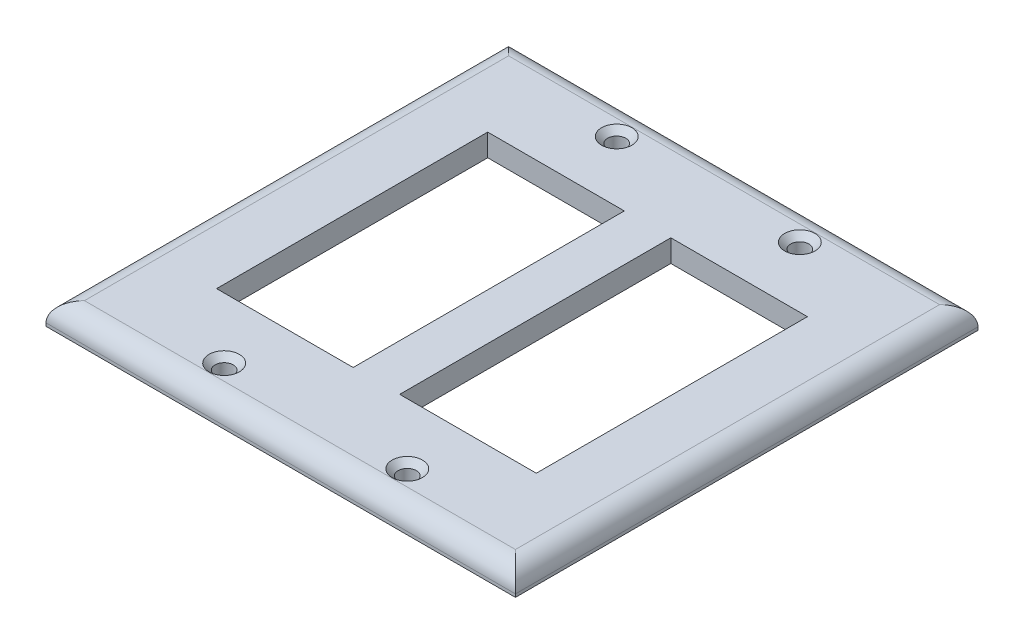
ISO-10303-21;
HEADER;
FILE_DESCRIPTION(('STEP AP214'),'2;1');
FILE_NAME('part.step','',(''),(''),'','','');
FILE_SCHEMA(('AUTOMOTIVE_DESIGN { 1 0 10303 214 1 1 1 1 }'));
ENDSEC;
DATA;
#1=APPLICATION_CONTEXT('core data for automotive mechanical design processes');
#2=APPLICATION_PROTOCOL_DEFINITION('international standard','automotive_design',2000,#1);
#3=PRODUCT_CONTEXT('',#1,'mechanical');
#4=PRODUCT('Part','Part','',(#3));
#5=PRODUCT_RELATED_PRODUCT_CATEGORY('part','',(#4));
#6=PRODUCT_DEFINITION_FORMATION('','',#4);
#7=PRODUCT_DEFINITION_CONTEXT('part definition',#1,'design');
#8=PRODUCT_DEFINITION('design','',#6,#7);
#9=PRODUCT_DEFINITION_SHAPE('','',#8);
#10=(LENGTH_UNIT() NAMED_UNIT(*) SI_UNIT(.MILLI.,.METRE.));
#11=(NAMED_UNIT(*) PLANE_ANGLE_UNIT() SI_UNIT($,.RADIAN.));
#12=(NAMED_UNIT(*) SI_UNIT($,.STERADIAN.) SOLID_ANGLE_UNIT());
#13=UNCERTAINTY_MEASURE_WITH_UNIT(LENGTH_MEASURE(1.E-05),#10,'distance_accuracy_value','');
#14=(GEOMETRIC_REPRESENTATION_CONTEXT(3) GLOBAL_UNCERTAINTY_ASSIGNED_CONTEXT((#13)) GLOBAL_UNIT_ASSIGNED_CONTEXT((#10,
#11,#12)) REPRESENTATION_CONTEXT('',''));
#15=CARTESIAN_POINT('',(0.,0.,0.));
#16=DIRECTION('',(0.,0.,1.));
#17=DIRECTION('',(1.,0.,0.));
#18=AXIS2_PLACEMENT_3D('',#15,#16,#17);
#19=CARTESIAN_POINT('',(0.,5.5,0.));
#20=DIRECTION('',(0.,1.,0.));
#21=DIRECTION('',(0.,0.,1.));
#22=AXIS2_PLACEMENT_3D('',#19,#20,#21);
#23=PLANE('',#22);
#24=CARTESIAN_POINT('',(30.7504052679415,5.5,75.6770644960488));
#25=DIRECTION('',(0.,1.,0.));
#26=DIRECTION('',(0.,0.,1.));
#27=AXIS2_PLACEMENT_3D('',#24,#25,#26);
#28=CIRCLE('',#27,3.75000000000002);
#29=CARTESIAN_POINT('',(30.7504052679415,5.5,79.4270644960488));
#30=VERTEX_POINT('',#29);
#31=EDGE_CURVE('E304',#30,#30,#28,.F.);
#32=ORIENTED_EDGE('',*,*,#31,.T.);
#33=EDGE_LOOP('',(#32));
#34=FACE_BOUND('',#33,.T.);
#35=CARTESIAN_POINT('',(-14.4995947320585,5.5,75.6770644960488));
#36=DIRECTION('',(0.,1.,0.));
#37=DIRECTION('',(0.,0.,1.));
#38=AXIS2_PLACEMENT_3D('',#35,#36,#37);
#39=CIRCLE('',#38,3.75000000000002);
#40=CARTESIAN_POINT('',(-14.4995947320585,5.5,79.4270644960488));
#41=VERTEX_POINT('',#40);
#42=EDGE_CURVE('E301',#41,#41,#39,.F.);
#43=ORIENTED_EDGE('',*,*,#42,.T.);
#44=EDGE_LOOP('',(#43));
#45=FACE_BOUND('',#44,.T.);
#46=CARTESIAN_POINT('',(30.7504052679415,5.5,-21.3229355039512));
#47=DIRECTION('',(0.,1.,0.));
#48=DIRECTION('',(0.,0.,1.));
#49=AXIS2_PLACEMENT_3D('',#46,#47,#48);
#50=CIRCLE('',#49,3.75000000000002);
#51=CARTESIAN_POINT('',(30.7504052679415,5.5,-17.5729355039512));
#52=VERTEX_POINT('',#51);
#53=EDGE_CURVE('E298',#52,#52,#50,.F.);
#54=ORIENTED_EDGE('',*,*,#53,.T.);
#55=EDGE_LOOP('',(#54));
#56=FACE_BOUND('',#55,.T.);
#57=CARTESIAN_POINT('',(-14.4995947320585,5.5,-21.3229355039512));
#58=DIRECTION('',(0.,1.,0.));
#59=DIRECTION('',(0.,0.,1.));
#60=AXIS2_PLACEMENT_3D('',#57,#58,#59);
#61=CIRCLE('',#60,3.75000000000002);
#62=CARTESIAN_POINT('',(-14.4995947320585,5.5,-17.5729355039512));
#63=VERTEX_POINT('',#62);
#64=EDGE_CURVE('E295',#63,#63,#61,.F.);
#65=ORIENTED_EDGE('',*,*,#64,.T.);
#66=EDGE_LOOP('',(#65));
#67=FACE_BOUND('',#66,.T.);
#68=DIRECTION('',(1.,0.,0.));
#69=VECTOR('',#68,1.);
#70=CARTESIAN_POINT('',(0.,5.5,-25.2229355039512));
#71=LINE('',#70,#69);
#72=CARTESIAN_POINT('',(61.3754052679415,5.5,-25.2229355039512));
#73=VERTEX_POINT('',#72);
#74=CARTESIAN_POINT('',(-45.1245947320585,5.5,-25.2229355039512));
#75=VERTEX_POINT('',#74);
#76=EDGE_CURVE('E260',#73,#75,#71,.F.);
#77=ORIENTED_EDGE('',*,*,#76,.T.);
#78=DIRECTION('',(0.,0.,1.));
#79=VECTOR('',#78,1.);
#80=CARTESIAN_POINT('',(-45.1245947320585,5.5,84.3270644960488));
#81=LINE('',#80,#79);
#82=CARTESIAN_POINT('',(-45.1245947320585,5.5,79.5770644960488));
#83=VERTEX_POINT('',#82);
#84=EDGE_CURVE('E273',#75,#83,#81,.T.);
#85=ORIENTED_EDGE('',*,*,#84,.T.);
#86=DIRECTION('',(1.,0.,0.));
#87=VECTOR('',#86,1.);
#88=CARTESIAN_POINT('',(66.1254052679415,5.5,79.5770644960488));
#89=LINE('',#88,#87);
#90=CARTESIAN_POINT('',(61.3754052679415,5.5,79.5770644960488));
#91=VERTEX_POINT('',#90);
#92=EDGE_CURVE('E271',#83,#91,#89,.T.);
#93=ORIENTED_EDGE('',*,*,#92,.T.);
#94=DIRECTION('',(0.,0.,1.));
#95=VECTOR('',#94,1.);
#96=CARTESIAN_POINT('',(61.3754052679415,5.5,0.));
#97=LINE('',#96,#95);
#98=EDGE_CURVE('E269',#91,#73,#97,.F.);
#99=ORIENTED_EDGE('',*,*,#98,.T.);
#100=EDGE_LOOP('',(#77,#85,#93,#99));
#101=FACE_BOUND('',#100,.T.);
#102=DIRECTION('',(0.,0.,1.));
#103=VECTOR('',#102,1.);
#104=CARTESIAN_POINT('',(13.8754052679415,5.5,0.));
#105=LINE('',#104,#103);
#106=CARTESIAN_POINT('',(13.8754052679415,5.5,-6.32293550395119));
#107=VERTEX_POINT('',#106);
#108=CARTESIAN_POINT('',(13.8754052679415,5.5,60.6770644960488));
#109=VERTEX_POINT('',#108);
#110=EDGE_CURVE('E204',#107,#109,#105,.T.);
#111=ORIENTED_EDGE('',*,*,#110,.F.);
#112=DIRECTION('',(1.,0.,0.));
#113=VECTOR('',#112,1.);
#114=CARTESIAN_POINT('',(0.,5.5,-6.32293550395119));
#115=LINE('',#114,#113);
#116=CARTESIAN_POINT('',(47.6254052679415,5.5,-6.32293550395119));
#117=VERTEX_POINT('',#116);
#118=EDGE_CURVE('E207',#107,#117,#115,.T.);
#119=ORIENTED_EDGE('',*,*,#118,.T.);
#120=DIRECTION('',(0.,0.,1.));
#121=VECTOR('',#120,1.);
#122=CARTESIAN_POINT('',(47.6254052679415,5.5,0.));
#123=LINE('',#122,#121);
#124=CARTESIAN_POINT('',(47.6254052679415,5.5,60.6770644960488));
#125=VERTEX_POINT('',#124);
#126=EDGE_CURVE('E211',#117,#125,#123,.T.);
#127=ORIENTED_EDGE('',*,*,#126,.T.);
#128=DIRECTION('',(1.,0.,0.));
#129=VECTOR('',#128,1.);
#130=CARTESIAN_POINT('',(0.,5.5,60.6770644960488));
#131=LINE('',#130,#129);
#132=EDGE_CURVE('E213',#109,#125,#131,.T.);
#133=ORIENTED_EDGE('',*,*,#132,.F.);
#134=EDGE_LOOP('',(#111,#119,#127,#133));
#135=FACE_BOUND('',#134,.T.);
#136=DIRECTION('',(0.,0.,1.));
#137=VECTOR('',#136,1.);
#138=CARTESIAN_POINT('',(2.37540526794149,5.5,-6.32293550395119));
#139=LINE('',#138,#137);
#140=CARTESIAN_POINT('',(2.37540526794149,5.5,-6.32293550395119));
#141=VERTEX_POINT('',#140);
#142=CARTESIAN_POINT('',(2.37540526794149,5.5,60.6770644960488));
#143=VERTEX_POINT('',#142);
#144=EDGE_CURVE('E172',#141,#143,#139,.T.);
#145=ORIENTED_EDGE('',*,*,#144,.T.);
#146=DIRECTION('',(1.,0.,0.));
#147=VECTOR('',#146,1.);
#148=CARTESIAN_POINT('',(-31.3745947320585,5.5,60.6770644960488));
#149=LINE('',#148,#147);
#150=CARTESIAN_POINT('',(-31.3745947320585,5.5,60.6770644960488));
#151=VERTEX_POINT('',#150);
#152=EDGE_CURVE('E162',#151,#143,#149,.T.);
#153=ORIENTED_EDGE('',*,*,#152,.F.);
#154=DIRECTION('',(0.,0.,1.));
#155=VECTOR('',#154,1.);
#156=CARTESIAN_POINT('',(-31.3745947320585,5.5,-6.32293550395119));
#157=LINE('',#156,#155);
#158=CARTESIAN_POINT('',(-31.3745947320585,5.5,-6.32293550395119));
#159=VERTEX_POINT('',#158);
#160=EDGE_CURVE('E187',#159,#151,#157,.T.);
#161=ORIENTED_EDGE('',*,*,#160,.F.);
#162=DIRECTION('',(1.,0.,0.));
#163=VECTOR('',#162,1.);
#164=CARTESIAN_POINT('',(-31.3745947320585,5.5,-6.32293550395119));
#165=LINE('',#164,#163);
#166=EDGE_CURVE('E185',#159,#141,#165,.T.);
#167=ORIENTED_EDGE('',*,*,#166,.T.);
#168=EDGE_LOOP('',(#145,#153,#161,#167));
#169=FACE_BOUND('',#168,.T.);
#170=ADVANCED_FACE('F60',(#34,#45,#56,#67,#101,#135,#169),#23,.T.);
#171=CARTESIAN_POINT('',(0.,0.,0.));
#172=DIRECTION('',(0.,1.,0.));
#173=DIRECTION('',(0.,0.,1.));
#174=AXIS2_PLACEMENT_3D('',#171,#172,#173);
#175=PLANE('',#174);
#176=DIRECTION('',(0.,0.,1.));
#177=VECTOR('',#176,1.);
#178=CARTESIAN_POINT('',(66.1254052679415,0.,0.));
#179=LINE('',#178,#177);
#180=CARTESIAN_POINT('',(66.1254052679415,0.,-29.9729355039512));
#181=VERTEX_POINT('',#180);
#182=CARTESIAN_POINT('',(66.1254052679415,0.,84.3270644960488));
#183=VERTEX_POINT('',#182);
#184=EDGE_CURVE('E240',#181,#183,#179,.T.);
#185=ORIENTED_EDGE('',*,*,#184,.T.);
#186=DIRECTION('',(1.,0.,0.));
#187=VECTOR('',#186,1.);
#188=CARTESIAN_POINT('',(0.,0.,84.3270644960488));
#189=LINE('',#188,#187);
#190=CARTESIAN_POINT('',(-49.8745947320585,0.,84.3270644960488));
#191=VERTEX_POINT('',#190);
#192=EDGE_CURVE('E208',#191,#183,#189,.T.);
#193=ORIENTED_EDGE('',*,*,#192,.F.);
#194=DIRECTION('',(0.,0.,1.));
#195=VECTOR('',#194,1.);
#196=CARTESIAN_POINT('',(-49.8745947320585,0.,0.));
#197=LINE('',#196,#195);
#198=CARTESIAN_POINT('',(-49.8745947320585,0.,-29.9729355039512));
#199=VERTEX_POINT('',#198);
#200=EDGE_CURVE('E246',#199,#191,#197,.T.);
#201=ORIENTED_EDGE('',*,*,#200,.F.);
#202=DIRECTION('',(1.,0.,0.));
#203=VECTOR('',#202,1.);
#204=CARTESIAN_POINT('',(0.,0.,-29.9729355039512));
#205=LINE('',#204,#203);
#206=EDGE_CURVE('E243',#199,#181,#205,.T.);
#207=ORIENTED_EDGE('',*,*,#206,.T.);
#208=EDGE_LOOP('',(#185,#193,#201,#207));
#209=FACE_BOUND('',#208,.T.);
#210=DIRECTION('',(0.,0.,1.));
#211=VECTOR('',#210,1.);
#212=CARTESIAN_POINT('',(13.8754052679415,0.,0.));
#213=LINE('',#212,#211);
#214=CARTESIAN_POINT('',(13.8754052679415,0.,-6.32293550395119));
#215=VERTEX_POINT('',#214);
#216=CARTESIAN_POINT('',(13.8754052679415,0.,60.6770644960488));
#217=VERTEX_POINT('',#216);
#218=EDGE_CURVE('E228',#215,#217,#213,.T.);
#219=ORIENTED_EDGE('',*,*,#218,.T.);
#220=DIRECTION('',(1.,0.,0.));
#221=VECTOR('',#220,1.);
#222=CARTESIAN_POINT('',(0.,0.,60.6770644960488));
#223=LINE('',#222,#221);
#224=CARTESIAN_POINT('',(47.6254052679415,0.,60.6770644960488));
#225=VERTEX_POINT('',#224);
#226=EDGE_CURVE('E237',#217,#225,#223,.T.);
#227=ORIENTED_EDGE('',*,*,#226,.T.);
#228=DIRECTION('',(0.,0.,1.));
#229=VECTOR('',#228,1.);
#230=CARTESIAN_POINT('',(47.6254052679415,0.,0.));
#231=LINE('',#230,#229);
#232=CARTESIAN_POINT('',(47.6254052679415,0.,-6.32293550395119));
#233=VERTEX_POINT('',#232);
#234=EDGE_CURVE('E234',#233,#225,#231,.T.);
#235=ORIENTED_EDGE('',*,*,#234,.F.);
#236=DIRECTION('',(1.,0.,0.));
#237=VECTOR('',#236,1.);
#238=CARTESIAN_POINT('',(0.,0.,-6.32293550395119));
#239=LINE('',#238,#237);
#240=EDGE_CURVE('E231',#215,#233,#239,.T.);
#241=ORIENTED_EDGE('',*,*,#240,.F.);
#242=EDGE_LOOP('',(#219,#227,#235,#241));
#243=FACE_BOUND('',#242,.T.);
#244=CARTESIAN_POINT('',(-14.4995947320585,0.,-21.3229355039512));
#245=DIRECTION('',(0.,1.,0.));
#246=DIRECTION('',(0.,0.,1.));
#247=AXIS2_PLACEMENT_3D('',#244,#245,#246);
#248=CIRCLE('',#247,2.25);
#249=CARTESIAN_POINT('',(-14.4995947320585,0.,-19.0729355039512));
#250=VERTEX_POINT('',#249);
#251=EDGE_CURVE('E225',#250,#250,#248,.T.);
#252=ORIENTED_EDGE('',*,*,#251,.T.);
#253=EDGE_LOOP('',(#252));
#254=FACE_BOUND('',#253,.T.);
#255=CARTESIAN_POINT('',(-14.4995947320585,0.,75.6770644960488));
#256=DIRECTION('',(0.,1.,0.));
#257=DIRECTION('',(0.,0.,1.));
#258=AXIS2_PLACEMENT_3D('',#255,#256,#257);
#259=CIRCLE('',#258,2.25);
#260=CARTESIAN_POINT('',(-14.4995947320585,0.,77.9270644960488));
#261=VERTEX_POINT('',#260);
#262=EDGE_CURVE('E222',#261,#261,#259,.T.);
#263=ORIENTED_EDGE('',*,*,#262,.T.);
#264=EDGE_LOOP('',(#263));
#265=FACE_BOUND('',#264,.T.);
#266=CARTESIAN_POINT('',(30.7504052679415,0.,75.6770644960488));
#267=DIRECTION('',(0.,1.,0.));
#268=DIRECTION('',(0.,0.,1.));
#269=AXIS2_PLACEMENT_3D('',#266,#267,#268);
#270=CIRCLE('',#269,2.25000000000001);
#271=CARTESIAN_POINT('',(30.7504052679415,0.,77.9270644960488));
#272=VERTEX_POINT('',#271);
#273=EDGE_CURVE('E219',#272,#272,#270,.T.);
#274=ORIENTED_EDGE('',*,*,#273,.T.);
#275=EDGE_LOOP('',(#274));
#276=FACE_BOUND('',#275,.T.);
#277=CARTESIAN_POINT('',(30.7504052679415,0.,-21.3229355039512));
#278=DIRECTION('',(0.,1.,0.));
#279=DIRECTION('',(0.,0.,1.));
#280=AXIS2_PLACEMENT_3D('',#277,#278,#279);
#281=CIRCLE('',#280,2.25);
#282=CARTESIAN_POINT('',(30.7504052679415,0.,-19.0729355039512));
#283=VERTEX_POINT('',#282);
#284=EDGE_CURVE('E182',#283,#283,#281,.T.);
#285=ORIENTED_EDGE('',*,*,#284,.T.);
#286=EDGE_LOOP('',(#285));
#287=FACE_BOUND('',#286,.T.);
#288=DIRECTION('',(1.,0.,0.));
#289=VECTOR('',#288,1.);
#290=CARTESIAN_POINT('',(-31.3745947320585,0.,60.6770644960488));
#291=LINE('',#290,#289);
#292=CARTESIAN_POINT('',(-31.3745947320585,0.,60.6770644960488));
#293=VERTEX_POINT('',#292);
#294=CARTESIAN_POINT('',(2.37540526794149,0.,60.6770644960488));
#295=VERTEX_POINT('',#294);
#296=EDGE_CURVE('E191',#293,#295,#291,.T.);
#297=ORIENTED_EDGE('',*,*,#296,.T.);
#298=DIRECTION('',(0.,0.,1.));
#299=VECTOR('',#298,1.);
#300=CARTESIAN_POINT('',(2.37540526794149,0.,-6.32293550395119));
#301=LINE('',#300,#299);
#302=CARTESIAN_POINT('',(2.37540526794149,0.,-6.32293550395119));
#303=VERTEX_POINT('',#302);
#304=EDGE_CURVE('E180',#303,#295,#301,.T.);
#305=ORIENTED_EDGE('',*,*,#304,.F.);
#306=DIRECTION('',(1.,0.,0.));
#307=VECTOR('',#306,1.);
#308=CARTESIAN_POINT('',(-31.3745947320585,0.,-6.32293550395119));
#309=LINE('',#308,#307);
#310=CARTESIAN_POINT('',(-31.3745947320585,0.,-6.32293550395119));
#311=VERTEX_POINT('',#310);
#312=EDGE_CURVE('E195',#311,#303,#309,.T.);
#313=ORIENTED_EDGE('',*,*,#312,.F.);
#314=DIRECTION('',(0.,0.,1.));
#315=VECTOR('',#314,1.);
#316=CARTESIAN_POINT('',(-31.3745947320585,0.,-6.32293550395119));
#317=LINE('',#316,#315);
#318=EDGE_CURVE('E173',#311,#293,#317,.T.);
#319=ORIENTED_EDGE('',*,*,#318,.T.);
#320=EDGE_LOOP('',(#297,#305,#313,#319));
#321=FACE_BOUND('',#320,.T.);
#322=ADVANCED_FACE('F329',(#209,#243,#254,#265,#276,#287,#321),#175,.F.);
#323=CARTESIAN_POINT('',(66.1254052679415,5.5,0.));
#324=DIRECTION('',(1.,0.,0.));
#325=DIRECTION('',(0.,0.,-1.));
#326=AXIS2_PLACEMENT_3D('',#323,#324,#325);
#327=PLANE('',#326);
#328=DIRECTION('',(0.,-1.,0.));
#329=VECTOR('',#328,1.);
#330=CARTESIAN_POINT('',(66.1254052679415,5.5,-29.9729355039512));
#331=LINE('',#330,#329);
#332=CARTESIAN_POINT('',(66.1254052679415,0.75,-29.9729355039512));
#333=VERTEX_POINT('',#332);
#334=EDGE_CURVE('E258',#333,#181,#331,.T.);
#335=ORIENTED_EDGE('',*,*,#334,.F.);
#336=DIRECTION('',(0.,0.,1.));
#337=VECTOR('',#336,1.);
#338=CARTESIAN_POINT('',(66.1254052679415,0.75,0.));
#339=LINE('',#338,#337);
#340=CARTESIAN_POINT('',(66.1254052679415,0.75,84.3270644960488));
#341=VERTEX_POINT('',#340);
#342=EDGE_CURVE('E82',#333,#341,#339,.T.);
#343=ORIENTED_EDGE('',*,*,#342,.T.);
#344=DIRECTION('',(0.,-1.,0.));
#345=VECTOR('',#344,1.);
#346=CARTESIAN_POINT('',(66.1254052679415,5.5,84.3270644960488));
#347=LINE('',#346,#345);
#348=EDGE_CURVE('E251',#341,#183,#347,.T.);
#349=ORIENTED_EDGE('',*,*,#348,.T.);
#350=ORIENTED_EDGE('',*,*,#184,.F.);
#351=EDGE_LOOP('',(#335,#343,#349,#350));
#352=FACE_BOUND('',#351,.T.);
#353=ADVANCED_FACE('F335',(#352),#327,.T.);
#354=CARTESIAN_POINT('',(0.,5.5,-29.9729355039512));
#355=DIRECTION('',(0.,0.,-1.));
#356=DIRECTION('',(-1.,0.,0.));
#357=AXIS2_PLACEMENT_3D('',#354,#355,#356);
#358=PLANE('',#357);
#359=DIRECTION('',(0.,-1.,0.));
#360=VECTOR('',#359,1.);
#361=CARTESIAN_POINT('',(-49.8745947320585,5.5,-29.9729355039512));
#362=LINE('',#361,#360);
#363=CARTESIAN_POINT('',(-49.8745947320585,0.75,-29.9729355039512));
#364=VERTEX_POINT('',#363);
#365=EDGE_CURVE('E256',#364,#199,#362,.T.);
#366=ORIENTED_EDGE('',*,*,#365,.F.);
#367=DIRECTION('',(1.,0.,0.));
#368=VECTOR('',#367,1.);
#369=CARTESIAN_POINT('',(0.,0.75,-29.9729355039512));
#370=LINE('',#369,#368);
#371=EDGE_CURVE('E75',#364,#333,#370,.T.);
#372=ORIENTED_EDGE('',*,*,#371,.T.);
#373=ORIENTED_EDGE('',*,*,#334,.T.);
#374=ORIENTED_EDGE('',*,*,#206,.F.);
#375=EDGE_LOOP('',(#366,#372,#373,#374));
#376=FACE_BOUND('',#375,.T.);
#377=ADVANCED_FACE('F350',(#376),#358,.T.);
#378=CARTESIAN_POINT('',(-49.8745947320585,5.5,0.));
#379=DIRECTION('',(1.,0.,0.));
#380=DIRECTION('',(0.,0.,-1.));
#381=AXIS2_PLACEMENT_3D('',#378,#379,#380);
#382=PLANE('',#381);
#383=DIRECTION('',(0.,-1.,0.));
#384=VECTOR('',#383,1.);
#385=CARTESIAN_POINT('',(-49.8745947320585,5.5,84.3270644960488));
#386=LINE('',#385,#384);
#387=CARTESIAN_POINT('',(-49.8745947320585,0.75,84.3270644960488));
#388=VERTEX_POINT('',#387);
#389=EDGE_CURVE('E253',#388,#191,#386,.T.);
#390=ORIENTED_EDGE('',*,*,#389,.F.);
#391=DIRECTION('',(0.,0.,1.));
#392=VECTOR('',#391,1.);
#393=CARTESIAN_POINT('',(-49.8745947320585,0.75,-29.9729355039512));
#394=LINE('',#393,#392);
#395=EDGE_CURVE('E276',#388,#364,#394,.F.);
#396=ORIENTED_EDGE('',*,*,#395,.T.);
#397=ORIENTED_EDGE('',*,*,#365,.T.);
#398=ORIENTED_EDGE('',*,*,#200,.T.);
#399=EDGE_LOOP('',(#390,#396,#397,#398));
#400=FACE_BOUND('',#399,.T.);
#401=ADVANCED_FACE('F346',(#400),#382,.F.);
#402=CARTESIAN_POINT('',(13.8754052679415,5.5,0.));
#403=DIRECTION('',(1.,0.,0.));
#404=DIRECTION('',(0.,0.,-1.));
#405=AXIS2_PLACEMENT_3D('',#402,#403,#404);
#406=PLANE('',#405);
#407=ORIENTED_EDGE('',*,*,#218,.F.);
#408=DIRECTION('',(0.,-1.,0.));
#409=VECTOR('',#408,1.);
#410=CARTESIAN_POINT('',(13.8754052679415,5.5,-6.32293550395119));
#411=LINE('',#410,#409);
#412=EDGE_CURVE('E254',#107,#215,#411,.T.);
#413=ORIENTED_EDGE('',*,*,#412,.F.);
#414=ORIENTED_EDGE('',*,*,#110,.T.);
#415=DIRECTION('',(0.,-1.,0.));
#416=VECTOR('',#415,1.);
#417=CARTESIAN_POINT('',(13.8754052679415,5.5,60.6770644960488));
#418=LINE('',#417,#416);
#419=EDGE_CURVE('E216',#109,#217,#418,.T.);
#420=ORIENTED_EDGE('',*,*,#419,.T.);
#421=EDGE_LOOP('',(#407,#413,#414,#420));
#422=FACE_BOUND('',#421,.T.);
#423=ADVANCED_FACE('F349',(#422),#406,.T.);
#424=CARTESIAN_POINT('',(0.,5.5,-6.32293550395119));
#425=DIRECTION('',(0.,0.,-1.));
#426=DIRECTION('',(-1.,0.,0.));
#427=AXIS2_PLACEMENT_3D('',#424,#425,#426);
#428=PLANE('',#427);
#429=ORIENTED_EDGE('',*,*,#240,.T.);
#430=DIRECTION('',(0.,-1.,0.));
#431=VECTOR('',#430,1.);
#432=CARTESIAN_POINT('',(47.6254052679415,5.5,-6.32293550395119));
#433=LINE('',#432,#431);
#434=EDGE_CURVE('E264',#117,#233,#433,.T.);
#435=ORIENTED_EDGE('',*,*,#434,.F.);
#436=ORIENTED_EDGE('',*,*,#118,.F.);
#437=ORIENTED_EDGE('',*,*,#412,.T.);
#438=EDGE_LOOP('',(#429,#435,#436,#437));
#439=FACE_BOUND('',#438,.T.);
#440=ADVANCED_FACE('F364',(#439),#428,.F.);
#441=CARTESIAN_POINT('',(47.6254052679415,5.5,0.));
#442=DIRECTION('',(1.,0.,0.));
#443=DIRECTION('',(0.,0.,-1.));
#444=AXIS2_PLACEMENT_3D('',#441,#442,#443);
#445=PLANE('',#444);
#446=ORIENTED_EDGE('',*,*,#234,.T.);
#447=DIRECTION('',(0.,-1.,0.));
#448=VECTOR('',#447,1.);
#449=CARTESIAN_POINT('',(47.6254052679415,5.5,60.6770644960488));
#450=LINE('',#449,#448);
#451=EDGE_CURVE('E262',#125,#225,#450,.T.);
#452=ORIENTED_EDGE('',*,*,#451,.F.);
#453=ORIENTED_EDGE('',*,*,#126,.F.);
#454=ORIENTED_EDGE('',*,*,#434,.T.);
#455=EDGE_LOOP('',(#446,#452,#453,#454));
#456=FACE_BOUND('',#455,.T.);
#457=ADVANCED_FACE('F360',(#456),#445,.F.);
#458=CARTESIAN_POINT('',(0.,5.5,60.6770644960488));
#459=DIRECTION('',(0.,0.,-1.));
#460=DIRECTION('',(-1.,0.,0.));
#461=AXIS2_PLACEMENT_3D('',#458,#459,#460);
#462=PLANE('',#461);
#463=ORIENTED_EDGE('',*,*,#226,.F.);
#464=ORIENTED_EDGE('',*,*,#419,.F.);
#465=ORIENTED_EDGE('',*,*,#132,.T.);
#466=ORIENTED_EDGE('',*,*,#451,.T.);
#467=EDGE_LOOP('',(#463,#464,#465,#466));
#468=FACE_BOUND('',#467,.T.);
#469=ADVANCED_FACE('F356',(#468),#462,.T.);
#470=CARTESIAN_POINT('',(-14.4995947320585,5.5,-21.3229355039512));
#471=DIRECTION('',(0.,-1.,0.));
#472=DIRECTION('',(0.,0.,-1.));
#473=AXIS2_PLACEMENT_3D('',#470,#471,#472);
#474=CYLINDRICAL_SURFACE('',#473,2.25);
#475=CARTESIAN_POINT('',(-14.4995947320585,3.99999999999997,-21.3229355039512));
#476=DIRECTION('',(0.,1.,0.));
#477=DIRECTION('',(0.,0.,1.));
#478=AXIS2_PLACEMENT_3D('',#475,#476,#477);
#479=CIRCLE('',#478,2.25);
#480=CARTESIAN_POINT('',(-14.4995947320585,3.99999999999997,-19.0729355039512));
#481=VERTEX_POINT('',#480);
#482=EDGE_CURVE('E12',#481,#481,#479,.T.);
#483=ORIENTED_EDGE('',*,*,#482,.T.);
#484=EDGE_LOOP('',(#483));
#485=FACE_BOUND('',#484,.T.);
#486=ORIENTED_EDGE('',*,*,#251,.F.);
#487=EDGE_LOOP('',(#486));
#488=FACE_BOUND('',#487,.T.);
#489=ADVANCED_FACE('F359',(#485,#488),#474,.F.);
#490=CARTESIAN_POINT('',(-14.4995947320585,5.5,75.6770644960488));
#491=DIRECTION('',(0.,-1.,0.));
#492=DIRECTION('',(0.,0.,-1.));
#493=AXIS2_PLACEMENT_3D('',#490,#491,#492);
#494=CYLINDRICAL_SURFACE('',#493,2.25);
#495=CARTESIAN_POINT('',(-14.4995947320585,3.99999999999998,75.6770644960488));
#496=DIRECTION('',(0.,1.,0.));
#497=DIRECTION('',(0.,0.,1.));
#498=AXIS2_PLACEMENT_3D('',#495,#496,#497);
#499=CIRCLE('',#498,2.25);
#500=CARTESIAN_POINT('',(-14.4995947320585,3.99999999999998,77.9270644960488));
#501=VERTEX_POINT('',#500);
#502=EDGE_CURVE('E307',#501,#501,#499,.T.);
#503=ORIENTED_EDGE('',*,*,#502,.T.);
#504=EDGE_LOOP('',(#503));
#505=FACE_BOUND('',#504,.T.);
#506=ORIENTED_EDGE('',*,*,#262,.F.);
#507=EDGE_LOOP('',(#506));
#508=FACE_BOUND('',#507,.T.);
#509=ADVANCED_FACE('F374',(#505,#508),#494,.F.);
#510=CARTESIAN_POINT('',(30.7504052679415,5.5,75.6770644960488));
#511=DIRECTION('',(0.,-1.,0.));
#512=DIRECTION('',(0.,0.,-1.));
#513=AXIS2_PLACEMENT_3D('',#510,#511,#512);
#514=CYLINDRICAL_SURFACE('',#513,2.25000000000001);
#515=CARTESIAN_POINT('',(30.7504052679415,3.99999999999998,75.6770644960488));
#516=DIRECTION('',(0.,1.,0.));
#517=DIRECTION('',(0.,0.,1.));
#518=AXIS2_PLACEMENT_3D('',#515,#516,#517);
#519=CIRCLE('',#518,2.25000000000001);
#520=CARTESIAN_POINT('',(30.7504052679415,3.99999999999998,77.9270644960488));
#521=VERTEX_POINT('',#520);
#522=EDGE_CURVE('E283',#521,#521,#519,.T.);
#523=ORIENTED_EDGE('',*,*,#522,.T.);
#524=EDGE_LOOP('',(#523));
#525=FACE_BOUND('',#524,.T.);
#526=ORIENTED_EDGE('',*,*,#273,.F.);
#527=EDGE_LOOP('',(#526));
#528=FACE_BOUND('',#527,.T.);
#529=ADVANCED_FACE('F378',(#525,#528),#514,.F.);
#530=CARTESIAN_POINT('',(30.7504052679415,5.5,-21.3229355039512));
#531=DIRECTION('',(0.,-1.,0.));
#532=DIRECTION('',(0.,0.,-1.));
#533=AXIS2_PLACEMENT_3D('',#530,#531,#532);
#534=CYLINDRICAL_SURFACE('',#533,2.25);
#535=CARTESIAN_POINT('',(30.7504052679415,3.99999999999998,-21.3229355039512));
#536=DIRECTION('',(0.,1.,0.));
#537=DIRECTION('',(0.,0.,1.));
#538=AXIS2_PLACEMENT_3D('',#535,#536,#537);
#539=CIRCLE('',#538,2.25);
#540=CARTESIAN_POINT('',(30.7504052679415,3.99999999999998,-19.0729355039512));
#541=VERTEX_POINT('',#540);
#542=EDGE_CURVE('E68',#541,#541,#539,.T.);
#543=ORIENTED_EDGE('',*,*,#542,.T.);
#544=EDGE_LOOP('',(#543));
#545=FACE_BOUND('',#544,.T.);
#546=ORIENTED_EDGE('',*,*,#284,.F.);
#547=EDGE_LOOP('',(#546));
#548=FACE_BOUND('',#547,.T.);
#549=ADVANCED_FACE('F312',(#545,#548),#534,.F.);
#550=CARTESIAN_POINT('',(0.,5.5,84.3270644960488));
#551=DIRECTION('',(0.,0.,-1.));
#552=DIRECTION('',(-1.,0.,0.));
#553=AXIS2_PLACEMENT_3D('',#550,#551,#552);
#554=PLANE('',#553);
#555=ORIENTED_EDGE('',*,*,#348,.F.);
#556=DIRECTION('',(1.,0.,0.));
#557=VECTOR('',#556,1.);
#558=CARTESIAN_POINT('',(-49.8745947320585,0.75,84.3270644960488));
#559=LINE('',#558,#557);
#560=EDGE_CURVE('E279',#341,#388,#559,.F.);
#561=ORIENTED_EDGE('',*,*,#560,.T.);
#562=ORIENTED_EDGE('',*,*,#389,.T.);
#563=ORIENTED_EDGE('',*,*,#192,.T.);
#564=EDGE_LOOP('',(#555,#561,#562,#563));
#565=FACE_BOUND('',#564,.T.);
#566=ADVANCED_FACE('F342',(#565),#554,.F.);
#567=CARTESIAN_POINT('',(-31.3745947320585,5.5,60.6770644960488));
#568=DIRECTION('',(0.,0.,-1.));
#569=DIRECTION('',(-1.,0.,0.));
#570=AXIS2_PLACEMENT_3D('',#567,#568,#569);
#571=PLANE('',#570);
#572=ORIENTED_EDGE('',*,*,#296,.F.);
#573=DIRECTION('',(0.,-1.,0.));
#574=VECTOR('',#573,1.);
#575=CARTESIAN_POINT('',(-31.3745947320585,5.5,60.6770644960488));
#576=LINE('',#575,#574);
#577=EDGE_CURVE('E168',#151,#293,#576,.T.);
#578=ORIENTED_EDGE('',*,*,#577,.F.);
#579=ORIENTED_EDGE('',*,*,#152,.T.);
#580=DIRECTION('',(0.,-1.,0.));
#581=VECTOR('',#580,1.);
#582=CARTESIAN_POINT('',(2.37540526794149,5.5,60.6770644960488));
#583=LINE('',#582,#581);
#584=EDGE_CURVE('E165',#143,#295,#583,.T.);
#585=ORIENTED_EDGE('',*,*,#584,.T.);
#586=EDGE_LOOP('',(#572,#578,#579,#585));
#587=FACE_BOUND('',#586,.T.);
#588=ADVANCED_FACE('F164',(#587),#571,.T.);
#589=CARTESIAN_POINT('',(2.37540526794149,5.5,-6.32293550395119));
#590=DIRECTION('',(1.,0.,0.));
#591=DIRECTION('',(0.,0.,-1.));
#592=AXIS2_PLACEMENT_3D('',#589,#590,#591);
#593=PLANE('',#592);
#594=ORIENTED_EDGE('',*,*,#304,.T.);
#595=ORIENTED_EDGE('',*,*,#584,.F.);
#596=ORIENTED_EDGE('',*,*,#144,.F.);
#597=DIRECTION('',(0.,-1.,0.));
#598=VECTOR('',#597,1.);
#599=CARTESIAN_POINT('',(2.37540526794149,5.5,-6.32293550395119));
#600=LINE('',#599,#598);
#601=EDGE_CURVE('E183',#141,#303,#600,.T.);
#602=ORIENTED_EDGE('',*,*,#601,.T.);
#603=EDGE_LOOP('',(#594,#595,#596,#602));
#604=FACE_BOUND('',#603,.T.);
#605=ADVANCED_FACE('F177',(#604),#593,.F.);
#606=CARTESIAN_POINT('',(-31.3745947320585,5.5,-6.32293550395119));
#607=DIRECTION('',(0.,0.,-1.));
#608=DIRECTION('',(-1.,0.,0.));
#609=AXIS2_PLACEMENT_3D('',#606,#607,#608);
#610=PLANE('',#609);
#611=ORIENTED_EDGE('',*,*,#312,.T.);
#612=ORIENTED_EDGE('',*,*,#601,.F.);
#613=ORIENTED_EDGE('',*,*,#166,.F.);
#614=DIRECTION('',(0.,-1.,0.));
#615=VECTOR('',#614,1.);
#616=CARTESIAN_POINT('',(-31.3745947320585,5.5,-6.32293550395119));
#617=LINE('',#616,#615);
#618=EDGE_CURVE('E201',#159,#311,#617,.T.);
#619=ORIENTED_EDGE('',*,*,#618,.T.);
#620=EDGE_LOOP('',(#611,#612,#613,#619));
#621=FACE_BOUND('',#620,.T.);
#622=ADVANCED_FACE('F420',(#621),#610,.F.);
#623=CARTESIAN_POINT('',(-31.3745947320585,5.5,-6.32293550395119));
#624=DIRECTION('',(1.,0.,0.));
#625=DIRECTION('',(0.,0.,-1.));
#626=AXIS2_PLACEMENT_3D('',#623,#624,#625);
#627=PLANE('',#626);
#628=ORIENTED_EDGE('',*,*,#318,.F.);
#629=ORIENTED_EDGE('',*,*,#618,.F.);
#630=ORIENTED_EDGE('',*,*,#160,.T.);
#631=ORIENTED_EDGE('',*,*,#577,.T.);
#632=EDGE_LOOP('',(#628,#629,#630,#631));
#633=FACE_BOUND('',#632,.T.);
#634=ADVANCED_FACE('F400',(#633),#627,.T.);
#635=CARTESIAN_POINT('',(61.3754052679415,0.75,0.));
#636=DIRECTION('',(0.,0.,1.));
#637=DIRECTION('',(1.,0.,0.));
#638=AXIS2_PLACEMENT_3D('',#635,#636,#637);
#639=CYLINDRICAL_SURFACE('',#638,4.75);
#640=CARTESIAN_POINT('',(61.3754052679415,0.75,79.5770644960488));
#641=DIRECTION('',(-0.707106781186547,0.,0.707106781186548));
#642=DIRECTION('',(0.707106781186548,0.,0.707106781186547));
#643=AXIS2_PLACEMENT_3D('',#640,#641,#642);
#644=ELLIPSE('',#643,6.7175144212722,4.75);
#645=EDGE_CURVE('E288',#341,#91,#644,.T.);
#646=ORIENTED_EDGE('',*,*,#645,.F.);
#647=ORIENTED_EDGE('',*,*,#342,.F.);
#648=CARTESIAN_POINT('',(61.3754052679415,0.75,-25.2229355039512));
#649=DIRECTION('',(0.707106781186548,0.,0.707106781186547));
#650=DIRECTION('',(0.707106781186547,0.,-0.707106781186548));
#651=AXIS2_PLACEMENT_3D('',#648,#649,#650);
#652=ELLIPSE('',#651,6.7175144212722,4.75);
#653=EDGE_CURVE('E193',#73,#333,#652,.F.);
#654=ORIENTED_EDGE('',*,*,#653,.F.);
#655=ORIENTED_EDGE('',*,*,#98,.F.);
#656=EDGE_LOOP('',(#646,#647,#654,#655));
#657=FACE_BOUND('',#656,.T.);
#658=ADVANCED_FACE('F396',(#657),#639,.T.);
#659=CARTESIAN_POINT('',(0.,0.75,-25.2229355039512));
#660=DIRECTION('',(1.,0.,0.));
#661=DIRECTION('',(0.,0.,-1.));
#662=AXIS2_PLACEMENT_3D('',#659,#660,#661);
#663=CYLINDRICAL_SURFACE('',#662,4.75);
#664=ORIENTED_EDGE('',*,*,#653,.T.);
#665=ORIENTED_EDGE('',*,*,#371,.F.);
#666=CARTESIAN_POINT('',(-45.1245947320585,0.75,-25.2229355039512));
#667=DIRECTION('',(0.707106781186547,0.,-0.707106781186548));
#668=DIRECTION('',(0.707106781186548,0.,0.707106781186547));
#669=AXIS2_PLACEMENT_3D('',#666,#667,#668);
#670=ELLIPSE('',#669,6.7175144212722,4.75);
#671=EDGE_CURVE('E286',#75,#364,#670,.F.);
#672=ORIENTED_EDGE('',*,*,#671,.F.);
#673=ORIENTED_EDGE('',*,*,#76,.F.);
#674=EDGE_LOOP('',(#664,#665,#672,#673));
#675=FACE_BOUND('',#674,.T.);
#676=ADVANCED_FACE('F392',(#675),#663,.T.);
#677=CARTESIAN_POINT('',(0.,0.75,79.5770644960488));
#678=DIRECTION('',(-1.,0.,0.));
#679=DIRECTION('',(0.,0.,1.));
#680=AXIS2_PLACEMENT_3D('',#677,#678,#679);
#681=CYLINDRICAL_SURFACE('',#680,4.75);
#682=ORIENTED_EDGE('',*,*,#645,.T.);
#683=ORIENTED_EDGE('',*,*,#92,.F.);
#684=CARTESIAN_POINT('',(-45.1245947320585,0.75,79.5770644960488));
#685=DIRECTION('',(-0.707106781186548,0.,-0.707106781186547));
#686=DIRECTION('',(-0.707106781186547,0.,0.707106781186548));
#687=AXIS2_PLACEMENT_3D('',#684,#685,#686);
#688=ELLIPSE('',#687,6.7175144212722,4.75);
#689=EDGE_CURVE('E284',#388,#83,#688,.T.);
#690=ORIENTED_EDGE('',*,*,#689,.F.);
#691=ORIENTED_EDGE('',*,*,#560,.F.);
#692=EDGE_LOOP('',(#682,#683,#690,#691));
#693=FACE_BOUND('',#692,.T.);
#694=ADVANCED_FACE('F388',(#693),#681,.T.);
#695=CARTESIAN_POINT('',(-45.1245947320585,0.75,0.));
#696=DIRECTION('',(0.,0.,-1.));
#697=DIRECTION('',(-1.,0.,0.));
#698=AXIS2_PLACEMENT_3D('',#695,#696,#697);
#699=CYLINDRICAL_SURFACE('',#698,4.75);
#700=ORIENTED_EDGE('',*,*,#671,.T.);
#701=ORIENTED_EDGE('',*,*,#395,.F.);
#702=ORIENTED_EDGE('',*,*,#689,.T.);
#703=ORIENTED_EDGE('',*,*,#84,.F.);
#704=EDGE_LOOP('',(#700,#701,#702,#703));
#705=FACE_BOUND('',#704,.T.);
#706=ADVANCED_FACE('F385',(#705),#699,.T.);
#707=CARTESIAN_POINT('',(30.7504052679415,3.99999999999998,75.6770644960488));
#708=DIRECTION('',(0.,1.,0.));
#709=DIRECTION('',(0.,0.,1.));
#710=AXIS2_PLACEMENT_3D('',#707,#708,#709);
#711=CONICAL_SURFACE('',#710,2.25000000000001,0.785398163397446);
#712=ORIENTED_EDGE('',*,*,#31,.F.);
#713=EDGE_LOOP('',(#712));
#714=FACE_BOUND('',#713,.T.);
#715=ORIENTED_EDGE('',*,*,#522,.F.);
#716=EDGE_LOOP('',(#715));
#717=FACE_BOUND('',#716,.T.);
#718=ADVANCED_FACE('F324',(#714,#717),#711,.F.);
#719=CARTESIAN_POINT('',(-14.4995947320585,3.99999999999998,75.6770644960488));
#720=DIRECTION('',(0.,1.,0.));
#721=DIRECTION('',(0.,0.,1.));
#722=AXIS2_PLACEMENT_3D('',#719,#720,#721);
#723=CONICAL_SURFACE('',#722,2.25,0.785398163397446);
#724=ORIENTED_EDGE('',*,*,#42,.F.);
#725=EDGE_LOOP('',(#724));
#726=FACE_BOUND('',#725,.T.);
#727=ORIENTED_EDGE('',*,*,#502,.F.);
#728=EDGE_LOOP('',(#727));
#729=FACE_BOUND('',#728,.T.);
#730=ADVANCED_FACE('F317',(#726,#729),#723,.F.);
#731=CARTESIAN_POINT('',(30.7504052679415,3.99999999999998,-21.3229355039512));
#732=DIRECTION('',(0.,1.,0.));
#733=DIRECTION('',(0.,0.,1.));
#734=AXIS2_PLACEMENT_3D('',#731,#732,#733);
#735=CONICAL_SURFACE('',#734,2.25,0.785398163397446);
#736=ORIENTED_EDGE('',*,*,#53,.F.);
#737=EDGE_LOOP('',(#736));
#738=FACE_BOUND('',#737,.T.);
#739=ORIENTED_EDGE('',*,*,#542,.F.);
#740=EDGE_LOOP('',(#739));
#741=FACE_BOUND('',#740,.T.);
#742=ADVANCED_FACE('F315',(#738,#741),#735,.F.);
#743=CARTESIAN_POINT('',(-14.4995947320585,3.99999999999997,-21.3229355039512));
#744=DIRECTION('',(0.,1.,0.));
#745=DIRECTION('',(0.,0.,1.));
#746=AXIS2_PLACEMENT_3D('',#743,#744,#745);
#747=CONICAL_SURFACE('',#746,2.25,0.785398163397446);
#748=ORIENTED_EDGE('',*,*,#64,.F.);
#749=EDGE_LOOP('',(#748));
#750=FACE_BOUND('',#749,.T.);
#751=ORIENTED_EDGE('',*,*,#482,.F.);
#752=EDGE_LOOP('',(#751));
#753=FACE_BOUND('',#752,.T.);
#754=ADVANCED_FACE('F62',(#750,#753),#747,.F.);
#755=CLOSED_SHELL('',(#170,#322,#353,#377,#401,#423,#440,#457,#469,#489,#509,#529,#549,#566,
#588,#605,#622,#634,#658,#676,#694,#706,#718,#730,#742,#754));
#756=MANIFOLD_SOLID_BREP('B2',#755);
#757=ADVANCED_BREP_SHAPE_REPRESENTATION('',(#18,#756),#14);
#758=SHAPE_DEFINITION_REPRESENTATION(#9,#757);
ENDSEC;
END-ISO-10303-21;
